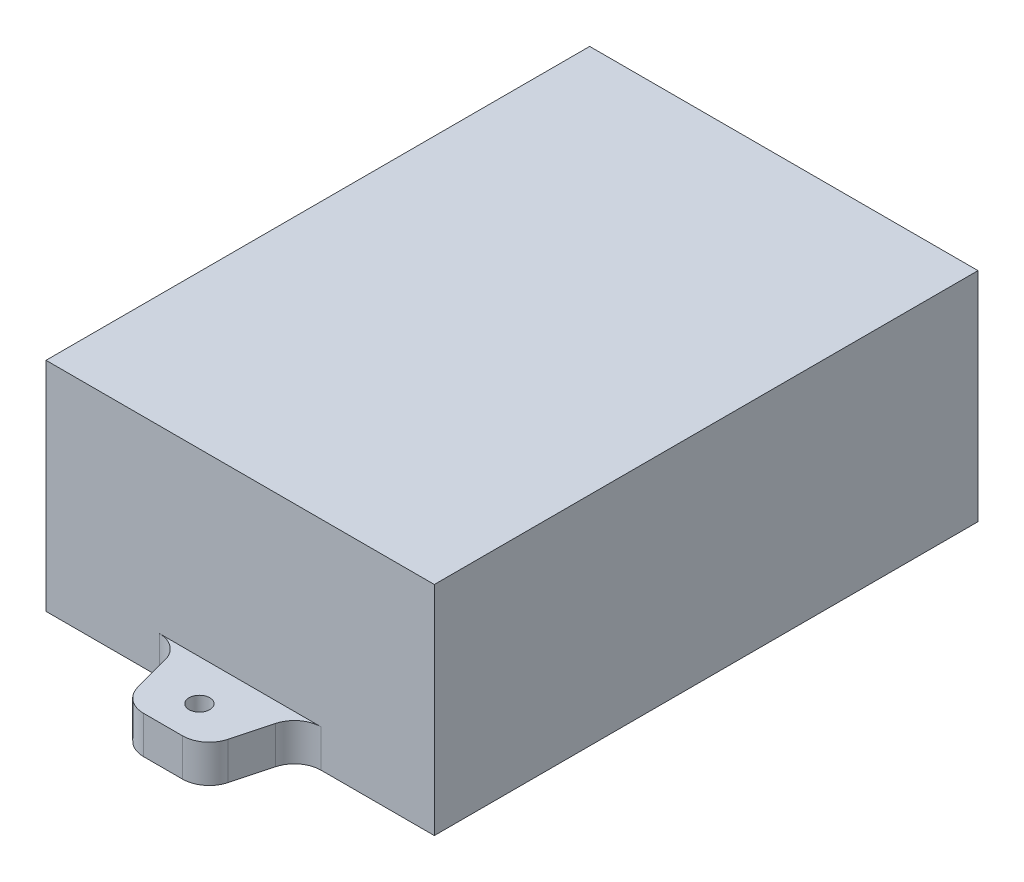
ISO-10303-21;
HEADER;
FILE_DESCRIPTION(('STEP AP214'),'2;1');
FILE_NAME('part.step','',(''),(''),'','','');
FILE_SCHEMA(('AUTOMOTIVE_DESIGN { 1 0 10303 214 1 1 1 1 }'));
ENDSEC;
DATA;
#1=APPLICATION_CONTEXT('core data for automotive mechanical design processes');
#2=APPLICATION_PROTOCOL_DEFINITION('international standard','automotive_design',2000,#1);
#3=PRODUCT_CONTEXT('',#1,'mechanical');
#4=PRODUCT('Part','Part','',(#3));
#5=PRODUCT_RELATED_PRODUCT_CATEGORY('part','',(#4));
#6=PRODUCT_DEFINITION_FORMATION('','',#4);
#7=PRODUCT_DEFINITION_CONTEXT('part definition',#1,'design');
#8=PRODUCT_DEFINITION('design','',#6,#7);
#9=PRODUCT_DEFINITION_SHAPE('','',#8);
#10=(LENGTH_UNIT() NAMED_UNIT(*) SI_UNIT(.MILLI.,.METRE.));
#11=(NAMED_UNIT(*) PLANE_ANGLE_UNIT() SI_UNIT($,.RADIAN.));
#12=(NAMED_UNIT(*) SI_UNIT($,.STERADIAN.) SOLID_ANGLE_UNIT());
#13=UNCERTAINTY_MEASURE_WITH_UNIT(LENGTH_MEASURE(1.E-05),#10,'distance_accuracy_value','');
#14=(GEOMETRIC_REPRESENTATION_CONTEXT(3) GLOBAL_UNCERTAINTY_ASSIGNED_CONTEXT((#13)) GLOBAL_UNIT_ASSIGNED_CONTEXT((#10,
#11,#12)) REPRESENTATION_CONTEXT('',''));
#15=CARTESIAN_POINT('',(0.,0.,0.));
#16=DIRECTION('',(0.,0.,1.));
#17=DIRECTION('',(1.,0.,0.));
#18=AXIS2_PLACEMENT_3D('',#15,#16,#17);
#19=CARTESIAN_POINT('',(30.,33.6,42.));
#20=DIRECTION('',(-1.,0.,0.));
#21=DIRECTION('',(0.,0.,1.));
#22=AXIS2_PLACEMENT_3D('',#19,#20,#21);
#23=PLANE('',#22);
#24=DIRECTION('',(0.,0.,-1.));
#25=VECTOR('',#24,1.);
#26=CARTESIAN_POINT('',(30.,0.,42.));
#27=LINE('',#26,#25);
#28=CARTESIAN_POINT('',(30.,0.,42.));
#29=VERTEX_POINT('',#28);
#30=CARTESIAN_POINT('',(30.,0.,-42.));
#31=VERTEX_POINT('',#30);
#32=EDGE_CURVE('E297',#29,#31,#27,.T.);
#33=ORIENTED_EDGE('',*,*,#32,.T.);
#34=DIRECTION('',(0.,-1.,0.));
#35=VECTOR('',#34,1.);
#36=CARTESIAN_POINT('',(30.,33.6,-42.));
#37=LINE('',#36,#35);
#38=CARTESIAN_POINT('',(30.,33.6,-42.));
#39=VERTEX_POINT('',#38);
#40=EDGE_CURVE('E11',#39,#31,#37,.T.);
#41=ORIENTED_EDGE('',*,*,#40,.F.);
#42=DIRECTION('',(0.,0.,-1.));
#43=VECTOR('',#42,1.);
#44=CARTESIAN_POINT('',(30.,33.6,42.));
#45=LINE('',#44,#43);
#46=CARTESIAN_POINT('',(30.,33.6,42.));
#47=VERTEX_POINT('',#46);
#48=EDGE_CURVE('E298',#47,#39,#45,.T.);
#49=ORIENTED_EDGE('',*,*,#48,.F.);
#50=DIRECTION('',(0.,-1.,0.));
#51=VECTOR('',#50,1.);
#52=CARTESIAN_POINT('',(30.,33.6,42.));
#53=LINE('',#52,#51);
#54=EDGE_CURVE('E308',#47,#29,#53,.T.);
#55=ORIENTED_EDGE('',*,*,#54,.T.);
#56=EDGE_LOOP('',(#33,#41,#49,#55));
#57=FACE_BOUND('',#56,.T.);
#58=ADVANCED_FACE('F36',(#57),#23,.F.);
#59=CARTESIAN_POINT('',(-30.,33.6,-42.));
#60=DIRECTION('',(0.,0.,1.));
#61=DIRECTION('',(1.,0.,0.));
#62=AXIS2_PLACEMENT_3D('',#59,#60,#61);
#63=PLANE('',#62);
#64=DIRECTION('',(1.,0.,0.));
#65=VECTOR('',#64,1.);
#66=CARTESIAN_POINT('',(-12.5,5.8,-42.));
#67=LINE('',#66,#65);
#68=CARTESIAN_POINT('',(-12.5,5.8,-42.));
#69=VERTEX_POINT('',#68);
#70=CARTESIAN_POINT('',(12.5,5.8,-42.));
#71=VERTEX_POINT('',#70);
#72=EDGE_CURVE('E244',#69,#71,#67,.T.);
#73=ORIENTED_EDGE('',*,*,#72,.F.);
#74=DIRECTION('',(0.,-1.,0.));
#75=VECTOR('',#74,1.);
#76=CARTESIAN_POINT('',(-12.5,5.8,-42.));
#77=LINE('',#76,#75);
#78=CARTESIAN_POINT('',(-12.5,0.,-42.));
#79=VERTEX_POINT('',#78);
#80=EDGE_CURVE('E294',#69,#79,#77,.T.);
#81=ORIENTED_EDGE('',*,*,#80,.T.);
#82=DIRECTION('',(-1.,0.,0.));
#83=VECTOR('',#82,1.);
#84=CARTESIAN_POINT('',(-30.,0.,-42.));
#85=LINE('',#84,#83);
#86=CARTESIAN_POINT('',(-30.,0.,-42.));
#87=VERTEX_POINT('',#86);
#88=EDGE_CURVE('E311',#79,#87,#85,.T.);
#89=ORIENTED_EDGE('',*,*,#88,.T.);
#90=DIRECTION('',(0.,-1.,0.));
#91=VECTOR('',#90,1.);
#92=CARTESIAN_POINT('',(-30.,33.6,-42.));
#93=LINE('',#92,#91);
#94=CARTESIAN_POINT('',(-30.,33.6,-42.));
#95=VERTEX_POINT('',#94);
#96=EDGE_CURVE('E43',#95,#87,#93,.T.);
#97=ORIENTED_EDGE('',*,*,#96,.F.);
#98=DIRECTION('',(-1.,0.,0.));
#99=VECTOR('',#98,1.);
#100=CARTESIAN_POINT('',(-30.,33.6,-42.));
#101=LINE('',#100,#99);
#102=EDGE_CURVE('E301',#39,#95,#101,.T.);
#103=ORIENTED_EDGE('',*,*,#102,.F.);
#104=ORIENTED_EDGE('',*,*,#40,.T.);
#105=CARTESIAN_POINT('',(12.5,0.,-42.));
#106=VERTEX_POINT('',#105);
#107=EDGE_CURVE('E312',#31,#106,#85,.T.);
#108=ORIENTED_EDGE('',*,*,#107,.T.);
#109=DIRECTION('',(0.,-1.,0.));
#110=VECTOR('',#109,1.);
#111=CARTESIAN_POINT('',(12.5,5.8,-42.));
#112=LINE('',#111,#110);
#113=EDGE_CURVE('E291',#71,#106,#112,.T.);
#114=ORIENTED_EDGE('',*,*,#113,.F.);
#115=EDGE_LOOP('',(#73,#81,#89,#97,#103,#104,#108,#114));
#116=FACE_BOUND('',#115,.T.);
#117=ADVANCED_FACE('F343',(#116),#63,.F.);
#118=CARTESIAN_POINT('',(-30.,33.6,42.));
#119=DIRECTION('',(1.,0.,0.));
#120=DIRECTION('',(0.,0.,-1.));
#121=AXIS2_PLACEMENT_3D('',#118,#119,#120);
#122=PLANE('',#121);
#123=DIRECTION('',(0.,0.,1.));
#124=VECTOR('',#123,1.);
#125=CARTESIAN_POINT('',(-30.,0.,42.));
#126=LINE('',#125,#124);
#127=CARTESIAN_POINT('',(-30.,0.,42.));
#128=VERTEX_POINT('',#127);
#129=EDGE_CURVE('E314',#87,#128,#126,.T.);
#130=ORIENTED_EDGE('',*,*,#129,.T.);
#131=DIRECTION('',(0.,-1.,0.));
#132=VECTOR('',#131,1.);
#133=CARTESIAN_POINT('',(-30.,33.6,42.));
#134=LINE('',#133,#132);
#135=CARTESIAN_POINT('',(-30.,33.6,42.));
#136=VERTEX_POINT('',#135);
#137=EDGE_CURVE('E320',#136,#128,#134,.T.);
#138=ORIENTED_EDGE('',*,*,#137,.F.);
#139=DIRECTION('',(0.,0.,1.));
#140=VECTOR('',#139,1.);
#141=CARTESIAN_POINT('',(-30.,33.6,42.));
#142=LINE('',#141,#140);
#143=EDGE_CURVE('E304',#95,#136,#142,.T.);
#144=ORIENTED_EDGE('',*,*,#143,.F.);
#145=ORIENTED_EDGE('',*,*,#96,.T.);
#146=EDGE_LOOP('',(#130,#138,#144,#145));
#147=FACE_BOUND('',#146,.T.);
#148=ADVANCED_FACE('F327',(#147),#122,.F.);
#149=CARTESIAN_POINT('',(-30.,33.6,42.));
#150=DIRECTION('',(0.,0.,-1.));
#151=DIRECTION('',(-1.,0.,0.));
#152=AXIS2_PLACEMENT_3D('',#149,#150,#151);
#153=PLANE('',#152);
#154=DIRECTION('',(-1.,0.,0.));
#155=VECTOR('',#154,1.);
#156=CARTESIAN_POINT('',(-12.5,5.8,42.));
#157=LINE('',#156,#155);
#158=CARTESIAN_POINT('',(12.5,5.8,42.));
#159=VERTEX_POINT('',#158);
#160=CARTESIAN_POINT('',(-12.5,5.8,42.));
#161=VERTEX_POINT('',#160);
#162=EDGE_CURVE('E50',#159,#161,#157,.T.);
#163=ORIENTED_EDGE('',*,*,#162,.F.);
#164=DIRECTION('',(0.,-1.,0.));
#165=VECTOR('',#164,1.);
#166=CARTESIAN_POINT('',(12.5,5.8,42.));
#167=LINE('',#166,#165);
#168=CARTESIAN_POINT('',(12.5,0.,42.));
#169=VERTEX_POINT('',#168);
#170=EDGE_CURVE('E232',#159,#169,#167,.T.);
#171=ORIENTED_EDGE('',*,*,#170,.T.);
#172=DIRECTION('',(1.,0.,0.));
#173=VECTOR('',#172,1.);
#174=CARTESIAN_POINT('',(-30.,0.,42.));
#175=LINE('',#174,#173);
#176=EDGE_CURVE('E316',#169,#29,#175,.T.);
#177=ORIENTED_EDGE('',*,*,#176,.T.);
#178=ORIENTED_EDGE('',*,*,#54,.F.);
#179=DIRECTION('',(1.,0.,0.));
#180=VECTOR('',#179,1.);
#181=CARTESIAN_POINT('',(-30.,33.6,42.));
#182=LINE('',#181,#180);
#183=EDGE_CURVE('E306',#136,#47,#182,.T.);
#184=ORIENTED_EDGE('',*,*,#183,.F.);
#185=ORIENTED_EDGE('',*,*,#137,.T.);
#186=CARTESIAN_POINT('',(-12.5,0.,42.));
#187=VERTEX_POINT('',#186);
#188=EDGE_CURVE('E302',#128,#187,#175,.T.);
#189=ORIENTED_EDGE('',*,*,#188,.T.);
#190=DIRECTION('',(0.,-1.,0.));
#191=VECTOR('',#190,1.);
#192=CARTESIAN_POINT('',(-12.5,5.8,42.));
#193=LINE('',#192,#191);
#194=EDGE_CURVE('E55',#161,#187,#193,.T.);
#195=ORIENTED_EDGE('',*,*,#194,.F.);
#196=EDGE_LOOP('',(#163,#171,#177,#178,#184,#185,#189,#195));
#197=FACE_BOUND('',#196,.T.);
#198=ADVANCED_FACE('F336',(#197),#153,.F.);
#199=CARTESIAN_POINT('',(0.,33.6,0.));
#200=DIRECTION('',(0.,-1.,0.));
#201=DIRECTION('',(0.,0.,-1.));
#202=AXIS2_PLACEMENT_3D('',#199,#200,#201);
#203=PLANE('',#202);
#204=ORIENTED_EDGE('',*,*,#48,.T.);
#205=ORIENTED_EDGE('',*,*,#102,.T.);
#206=ORIENTED_EDGE('',*,*,#143,.T.);
#207=ORIENTED_EDGE('',*,*,#183,.T.);
#208=EDGE_LOOP('',(#204,#205,#206,#207));
#209=FACE_BOUND('',#208,.T.);
#210=ADVANCED_FACE('F341',(#209),#203,.F.);
#211=CARTESIAN_POINT('',(0.,0.,0.));
#212=DIRECTION('',(0.,-1.,0.));
#213=DIRECTION('',(0.,0.,-1.));
#214=AXIS2_PLACEMENT_3D('',#211,#212,#213);
#215=PLANE('',#214);
#216=ORIENTED_EDGE('',*,*,#32,.F.);
#217=ORIENTED_EDGE('',*,*,#176,.F.);
#218=CARTESIAN_POINT('',(12.5,0.,46.1125913130549));
#219=DIRECTION('',(0.,-1.,0.));
#220=DIRECTION('',(0.,0.,-1.));
#221=AXIS2_PLACEMENT_3D('',#218,#219,#220);
#222=CIRCLE('',#221,4.11259131305487);
#223=CARTESIAN_POINT('',(8.52754183774822,0.,45.0481743565131));
#224=VERTEX_POINT('',#223);
#225=EDGE_CURVE('E203',#224,#169,#222,.T.);
#226=ORIENTED_EDGE('',*,*,#225,.F.);
#227=DIRECTION('',(0.258819045102518,0.,-0.965925826289069));
#228=VECTOR('',#227,1.);
#229=CARTESIAN_POINT('',(6.97245816225176,0.,50.8518256434869));
#230=LINE('',#229,#228);
#231=CARTESIAN_POINT('',(6.97245816225176,0.,50.8518256434869));
#232=VERTEX_POINT('',#231);
#233=EDGE_CURVE('E216',#232,#224,#230,.T.);
#234=ORIENTED_EDGE('',*,*,#233,.F.);
#235=CARTESIAN_POINT('',(2.99999999999999,0.,49.7874086869451));
#236=DIRECTION('',(0.,1.,0.));
#237=DIRECTION('',(0.,0.,1.));
#238=AXIS2_PLACEMENT_3D('',#235,#236,#237);
#239=CIRCLE('',#238,4.11259131305487);
#240=CARTESIAN_POINT('',(2.99999999999999,0.,53.9));
#241=VERTEX_POINT('',#240);
#242=EDGE_CURVE('E214',#241,#232,#239,.T.);
#243=ORIENTED_EDGE('',*,*,#242,.F.);
#244=DIRECTION('',(1.,0.,0.));
#245=VECTOR('',#244,1.);
#246=CARTESIAN_POINT('',(-3.00000000000001,0.,53.9));
#247=LINE('',#246,#245);
#248=CARTESIAN_POINT('',(-3.00000000000001,0.,53.9));
#249=VERTEX_POINT('',#248);
#250=EDGE_CURVE('E212',#249,#241,#247,.T.);
#251=ORIENTED_EDGE('',*,*,#250,.F.);
#252=CARTESIAN_POINT('',(-3.00000000000001,0.,49.7874086869451));
#253=DIRECTION('',(0.,1.,0.));
#254=DIRECTION('',(0.,0.,-1.));
#255=AXIS2_PLACEMENT_3D('',#252,#253,#254);
#256=CIRCLE('',#255,4.11259131305487);
#257=CARTESIAN_POINT('',(-6.97245816225178,0.,50.8518256434869));
#258=VERTEX_POINT('',#257);
#259=EDGE_CURVE('E210',#258,#249,#256,.T.);
#260=ORIENTED_EDGE('',*,*,#259,.F.);
#261=DIRECTION('',(0.258819045102518,0.,0.965925826289069));
#262=VECTOR('',#261,1.);
#263=CARTESIAN_POINT('',(-8.52754183774825,0.,45.0481743565131));
#264=LINE('',#263,#262);
#265=CARTESIAN_POINT('',(-8.52754183774825,0.,45.0481743565131));
#266=VERTEX_POINT('',#265);
#267=EDGE_CURVE('E208',#266,#258,#264,.T.);
#268=ORIENTED_EDGE('',*,*,#267,.F.);
#269=CARTESIAN_POINT('',(-12.5,0.,46.1125913130549));
#270=DIRECTION('',(0.,-1.,0.));
#271=DIRECTION('',(0.,0.,-1.));
#272=AXIS2_PLACEMENT_3D('',#269,#270,#271);
#273=CIRCLE('',#272,4.11259131305487);
#274=EDGE_CURVE('E183',#187,#266,#273,.T.);
#275=ORIENTED_EDGE('',*,*,#274,.F.);
#276=ORIENTED_EDGE('',*,*,#188,.F.);
#277=ORIENTED_EDGE('',*,*,#129,.F.);
#278=ORIENTED_EDGE('',*,*,#88,.F.);
#279=CARTESIAN_POINT('',(-12.5,0.,-46.1125913130549));
#280=DIRECTION('',(0.,-1.,0.));
#281=DIRECTION('',(0.,0.,1.));
#282=AXIS2_PLACEMENT_3D('',#279,#280,#281);
#283=CIRCLE('',#282,4.11259131305487);
#284=CARTESIAN_POINT('',(-8.52754183774823,0.,-45.0481743565131));
#285=VERTEX_POINT('',#284);
#286=EDGE_CURVE('E238',#285,#79,#283,.T.);
#287=ORIENTED_EDGE('',*,*,#286,.F.);
#288=DIRECTION('',(-0.258819045102518,0.,0.965925826289069));
#289=VECTOR('',#288,1.);
#290=CARTESIAN_POINT('',(-8.52754183774823,0.,-45.0481743565131));
#291=LINE('',#290,#289);
#292=CARTESIAN_POINT('',(-6.97245816225177,0.,-50.8518256434869));
#293=VERTEX_POINT('',#292);
#294=EDGE_CURVE('E245',#293,#285,#291,.T.);
#295=ORIENTED_EDGE('',*,*,#294,.F.);
#296=CARTESIAN_POINT('',(-3.,0.,-49.7874086869451));
#297=DIRECTION('',(0.,1.,0.));
#298=DIRECTION('',(0.,0.,1.));
#299=AXIS2_PLACEMENT_3D('',#296,#297,#298);
#300=CIRCLE('',#299,4.11259131305487);
#301=CARTESIAN_POINT('',(-3.,0.,-53.9));
#302=VERTEX_POINT('',#301);
#303=EDGE_CURVE('E271',#302,#293,#300,.T.);
#304=ORIENTED_EDGE('',*,*,#303,.F.);
#305=DIRECTION('',(-1.,0.,0.));
#306=VECTOR('',#305,1.);
#307=CARTESIAN_POINT('',(-3.,0.,-53.9));
#308=LINE('',#307,#306);
#309=CARTESIAN_POINT('',(3.,0.,-53.9));
#310=VERTEX_POINT('',#309);
#311=EDGE_CURVE('E269',#310,#302,#308,.T.);
#312=ORIENTED_EDGE('',*,*,#311,.F.);
#313=CARTESIAN_POINT('',(3.,0.,-49.7874086869451));
#314=DIRECTION('',(0.,1.,0.));
#315=DIRECTION('',(0.,0.,-1.));
#316=AXIS2_PLACEMENT_3D('',#313,#314,#315);
#317=CIRCLE('',#316,4.11259131305487);
#318=CARTESIAN_POINT('',(6.97245816225177,0.,-50.8518256434869));
#319=VERTEX_POINT('',#318);
#320=EDGE_CURVE('E267',#319,#310,#317,.T.);
#321=ORIENTED_EDGE('',*,*,#320,.F.);
#322=DIRECTION('',(-0.258819045102518,0.,-0.965925826289069));
#323=VECTOR('',#322,1.);
#324=CARTESIAN_POINT('',(6.97245816225177,0.,-50.8518256434869));
#325=LINE('',#324,#323);
#326=CARTESIAN_POINT('',(8.52754183774822,0.,-45.0481743565131));
#327=VERTEX_POINT('',#326);
#328=EDGE_CURVE('E265',#327,#319,#325,.T.);
#329=ORIENTED_EDGE('',*,*,#328,.F.);
#330=CARTESIAN_POINT('',(12.5,0.,-46.1125913130549));
#331=DIRECTION('',(0.,-1.,0.));
#332=DIRECTION('',(0.,0.,1.));
#333=AXIS2_PLACEMENT_3D('',#330,#331,#332);
#334=CIRCLE('',#333,4.11259131305487);
#335=EDGE_CURVE('E263',#106,#327,#334,.T.);
#336=ORIENTED_EDGE('',*,*,#335,.F.);
#337=ORIENTED_EDGE('',*,*,#107,.F.);
#338=EDGE_LOOP('',(#216,#217,#226,#234,#243,#251,#260,#268,#275,#276,#277,#278,#287,#295,#304,
#312,#321,#329,#336,#337));
#339=FACE_BOUND('',#338,.T.);
#340=CARTESIAN_POINT('',(0.,0.,-48.3));
#341=DIRECTION('',(0.,1.,0.));
#342=DIRECTION('',(0.,0.,1.));
#343=AXIS2_PLACEMENT_3D('',#340,#341,#342);
#344=CIRCLE('',#343,1.6);
#345=CARTESIAN_POINT('',(0.,0.,-46.7));
#346=VERTEX_POINT('',#345);
#347=EDGE_CURVE('E234',#346,#346,#344,.T.);
#348=ORIENTED_EDGE('',*,*,#347,.T.);
#349=EDGE_LOOP('',(#348));
#350=FACE_BOUND('',#349,.T.);
#351=CARTESIAN_POINT('',(0.,0.,48.3));
#352=DIRECTION('',(0.,1.,0.));
#353=DIRECTION('',(0.,0.,-1.));
#354=AXIS2_PLACEMENT_3D('',#351,#352,#353);
#355=CIRCLE('',#354,1.6);
#356=CARTESIAN_POINT('',(0.,0.,46.7));
#357=VERTEX_POINT('',#356);
#358=EDGE_CURVE('E598',#357,#357,#355,.T.);
#359=ORIENTED_EDGE('',*,*,#358,.T.);
#360=EDGE_LOOP('',(#359));
#361=FACE_BOUND('',#360,.T.);
#362=ADVANCED_FACE('F333',(#339,#350,#361),#215,.T.);
#363=CARTESIAN_POINT('',(-12.5,5.8,-46.1125913130549));
#364=DIRECTION('',(0.,1.,0.));
#365=DIRECTION('',(0.,0.,1.));
#366=AXIS2_PLACEMENT_3D('',#363,#364,#365);
#367=PLANE('',#366);
#368=CARTESIAN_POINT('',(-12.5,5.8,-46.1125913130549));
#369=DIRECTION('',(0.,-1.,0.));
#370=DIRECTION('',(0.,0.,1.));
#371=AXIS2_PLACEMENT_3D('',#368,#369,#370);
#372=CIRCLE('',#371,4.11259131305487);
#373=CARTESIAN_POINT('',(-8.52754183774823,5.8,-45.0481743565131));
#374=VERTEX_POINT('',#373);
#375=EDGE_CURVE('E241',#374,#69,#372,.T.);
#376=ORIENTED_EDGE('',*,*,#375,.T.);
#377=ORIENTED_EDGE('',*,*,#72,.T.);
#378=CARTESIAN_POINT('',(12.5,5.8,-46.1125913130549));
#379=DIRECTION('',(0.,-1.,0.));
#380=DIRECTION('',(0.,0.,1.));
#381=AXIS2_PLACEMENT_3D('',#378,#379,#380);
#382=CIRCLE('',#381,4.11259131305487);
#383=CARTESIAN_POINT('',(8.52754183774822,5.8,-45.0481743565131));
#384=VERTEX_POINT('',#383);
#385=EDGE_CURVE('E248',#71,#384,#382,.T.);
#386=ORIENTED_EDGE('',*,*,#385,.T.);
#387=DIRECTION('',(-0.258819045102518,0.,-0.965925826289069));
#388=VECTOR('',#387,1.);
#389=CARTESIAN_POINT('',(6.97245816225177,5.8,-50.8518256434869));
#390=LINE('',#389,#388);
#391=CARTESIAN_POINT('',(6.97245816225177,5.8,-50.8518256434869));
#392=VERTEX_POINT('',#391);
#393=EDGE_CURVE('E250',#384,#392,#390,.T.);
#394=ORIENTED_EDGE('',*,*,#393,.T.);
#395=CARTESIAN_POINT('',(3.,5.8,-49.7874086869451));
#396=DIRECTION('',(0.,1.,0.));
#397=DIRECTION('',(0.,0.,-1.));
#398=AXIS2_PLACEMENT_3D('',#395,#396,#397);
#399=CIRCLE('',#398,4.11259131305487);
#400=CARTESIAN_POINT('',(3.,5.8,-53.9));
#401=VERTEX_POINT('',#400);
#402=EDGE_CURVE('E252',#392,#401,#399,.T.);
#403=ORIENTED_EDGE('',*,*,#402,.T.);
#404=DIRECTION('',(-1.,0.,0.));
#405=VECTOR('',#404,1.);
#406=CARTESIAN_POINT('',(-3.,5.8,-53.9));
#407=LINE('',#406,#405);
#408=CARTESIAN_POINT('',(-3.,5.8,-53.9));
#409=VERTEX_POINT('',#408);
#410=EDGE_CURVE('E254',#401,#409,#407,.T.);
#411=ORIENTED_EDGE('',*,*,#410,.T.);
#412=CARTESIAN_POINT('',(-3.,5.8,-49.7874086869451));
#413=DIRECTION('',(0.,1.,0.));
#414=DIRECTION('',(0.,0.,1.));
#415=AXIS2_PLACEMENT_3D('',#412,#413,#414);
#416=CIRCLE('',#415,4.11259131305487);
#417=CARTESIAN_POINT('',(-6.97245816225177,5.8,-50.8518256434869));
#418=VERTEX_POINT('',#417);
#419=EDGE_CURVE('E256',#409,#418,#416,.T.);
#420=ORIENTED_EDGE('',*,*,#419,.T.);
#421=DIRECTION('',(-0.258819045102518,0.,0.965925826289069));
#422=VECTOR('',#421,1.);
#423=CARTESIAN_POINT('',(-8.52754183774823,5.8,-45.0481743565131));
#424=LINE('',#423,#422);
#425=EDGE_CURVE('E258',#418,#374,#424,.T.);
#426=ORIENTED_EDGE('',*,*,#425,.T.);
#427=EDGE_LOOP('',(#376,#377,#386,#394,#403,#411,#420,#426));
#428=FACE_BOUND('',#427,.T.);
#429=CARTESIAN_POINT('',(0.,5.8,-48.3));
#430=DIRECTION('',(0.,1.,0.));
#431=DIRECTION('',(0.,0.,1.));
#432=AXIS2_PLACEMENT_3D('',#429,#430,#431);
#433=CIRCLE('',#432,1.6);
#434=CARTESIAN_POINT('',(0.,5.8,-46.7));
#435=VERTEX_POINT('',#434);
#436=EDGE_CURVE('E235',#435,#435,#433,.T.);
#437=ORIENTED_EDGE('',*,*,#436,.F.);
#438=EDGE_LOOP('',(#437));
#439=FACE_BOUND('',#438,.T.);
#440=ADVANCED_FACE('F359',(#428,#439),#367,.T.);
#441=CARTESIAN_POINT('',(-12.5,5.8,-46.1125913130549));
#442=DIRECTION('',(0.,-1.,0.));
#443=DIRECTION('',(0.,0.,-1.));
#444=AXIS2_PLACEMENT_3D('',#441,#442,#443);
#445=CYLINDRICAL_SURFACE('',#444,4.11259131305487);
#446=ORIENTED_EDGE('',*,*,#286,.T.);
#447=ORIENTED_EDGE('',*,*,#80,.F.);
#448=ORIENTED_EDGE('',*,*,#375,.F.);
#449=DIRECTION('',(0.,-1.,0.));
#450=VECTOR('',#449,1.);
#451=CARTESIAN_POINT('',(-8.52754183774823,5.8,-45.0481743565131));
#452=LINE('',#451,#450);
#453=EDGE_CURVE('E260',#374,#285,#452,.T.);
#454=ORIENTED_EDGE('',*,*,#453,.T.);
#455=EDGE_LOOP('',(#446,#447,#448,#454));
#456=FACE_BOUND('',#455,.T.);
#457=ADVANCED_FACE('F365',(#456),#445,.F.);
#458=CARTESIAN_POINT('',(12.5,5.8,-46.1125913130549));
#459=DIRECTION('',(0.,-1.,0.));
#460=DIRECTION('',(0.,0.,-1.));
#461=AXIS2_PLACEMENT_3D('',#458,#459,#460);
#462=CYLINDRICAL_SURFACE('',#461,4.11259131305487);
#463=ORIENTED_EDGE('',*,*,#335,.T.);
#464=DIRECTION('',(0.,-1.,0.));
#465=VECTOR('',#464,1.);
#466=CARTESIAN_POINT('',(8.52754183774822,5.8,-45.0481743565131));
#467=LINE('',#466,#465);
#468=EDGE_CURVE('E288',#384,#327,#467,.T.);
#469=ORIENTED_EDGE('',*,*,#468,.F.);
#470=ORIENTED_EDGE('',*,*,#385,.F.);
#471=ORIENTED_EDGE('',*,*,#113,.T.);
#472=EDGE_LOOP('',(#463,#469,#470,#471));
#473=FACE_BOUND('',#472,.T.);
#474=ADVANCED_FACE('F351',(#473),#462,.F.);
#475=CARTESIAN_POINT('',(6.97245816225177,5.8,-50.8518256434869));
#476=DIRECTION('',(-0.965925826289069,0.,0.258819045102518));
#477=DIRECTION('',(0.258819045102518,0.,0.965925826289069));
#478=AXIS2_PLACEMENT_3D('',#475,#476,#477);
#479=PLANE('',#478);
#480=ORIENTED_EDGE('',*,*,#328,.T.);
#481=DIRECTION('',(0.,-1.,0.));
#482=VECTOR('',#481,1.);
#483=CARTESIAN_POINT('',(6.97245816225177,5.8,-50.8518256434869));
#484=LINE('',#483,#482);
#485=EDGE_CURVE('E285',#392,#319,#484,.T.);
#486=ORIENTED_EDGE('',*,*,#485,.F.);
#487=ORIENTED_EDGE('',*,*,#393,.F.);
#488=ORIENTED_EDGE('',*,*,#468,.T.);
#489=EDGE_LOOP('',(#480,#486,#487,#488));
#490=FACE_BOUND('',#489,.T.);
#491=ADVANCED_FACE('F355',(#490),#479,.F.);
#492=CARTESIAN_POINT('',(3.,5.8,-49.7874086869451));
#493=DIRECTION('',(0.,-1.,0.));
#494=DIRECTION('',(0.,0.,-1.));
#495=AXIS2_PLACEMENT_3D('',#492,#493,#494);
#496=CYLINDRICAL_SURFACE('',#495,4.11259131305487);
#497=ORIENTED_EDGE('',*,*,#320,.T.);
#498=DIRECTION('',(0.,-1.,0.));
#499=VECTOR('',#498,1.);
#500=CARTESIAN_POINT('',(3.,5.8,-53.9));
#501=LINE('',#500,#499);
#502=EDGE_CURVE('E282',#401,#310,#501,.T.);
#503=ORIENTED_EDGE('',*,*,#502,.F.);
#504=ORIENTED_EDGE('',*,*,#402,.F.);
#505=ORIENTED_EDGE('',*,*,#485,.T.);
#506=EDGE_LOOP('',(#497,#503,#504,#505));
#507=FACE_BOUND('',#506,.T.);
#508=ADVANCED_FACE('F382',(#507),#496,.T.);
#509=CARTESIAN_POINT('',(-3.,5.8,-53.9));
#510=DIRECTION('',(0.,0.,1.));
#511=DIRECTION('',(1.,0.,0.));
#512=AXIS2_PLACEMENT_3D('',#509,#510,#511);
#513=PLANE('',#512);
#514=ORIENTED_EDGE('',*,*,#311,.T.);
#515=DIRECTION('',(0.,-1.,0.));
#516=VECTOR('',#515,1.);
#517=CARTESIAN_POINT('',(-3.,5.8,-53.9));
#518=LINE('',#517,#516);
#519=EDGE_CURVE('E279',#409,#302,#518,.T.);
#520=ORIENTED_EDGE('',*,*,#519,.F.);
#521=ORIENTED_EDGE('',*,*,#410,.F.);
#522=ORIENTED_EDGE('',*,*,#502,.T.);
#523=EDGE_LOOP('',(#514,#520,#521,#522));
#524=FACE_BOUND('',#523,.T.);
#525=ADVANCED_FACE('F380',(#524),#513,.F.);
#526=CARTESIAN_POINT('',(-3.,5.8,-49.7874086869451));
#527=DIRECTION('',(0.,-1.,0.));
#528=DIRECTION('',(0.,0.,-1.));
#529=AXIS2_PLACEMENT_3D('',#526,#527,#528);
#530=CYLINDRICAL_SURFACE('',#529,4.11259131305487);
#531=ORIENTED_EDGE('',*,*,#303,.T.);
#532=DIRECTION('',(0.,-1.,0.));
#533=VECTOR('',#532,1.);
#534=CARTESIAN_POINT('',(-6.97245816225177,5.8,-50.8518256434869));
#535=LINE('',#534,#533);
#536=EDGE_CURVE('E276',#418,#293,#535,.T.);
#537=ORIENTED_EDGE('',*,*,#536,.F.);
#538=ORIENTED_EDGE('',*,*,#419,.F.);
#539=ORIENTED_EDGE('',*,*,#519,.T.);
#540=EDGE_LOOP('',(#531,#537,#538,#539));
#541=FACE_BOUND('',#540,.T.);
#542=ADVANCED_FACE('F376',(#541),#530,.T.);
#543=CARTESIAN_POINT('',(-8.52754183774823,5.8,-45.0481743565131));
#544=DIRECTION('',(0.965925826289069,0.,0.258819045102518));
#545=DIRECTION('',(0.258819045102518,0.,-0.965925826289069));
#546=AXIS2_PLACEMENT_3D('',#543,#544,#545);
#547=PLANE('',#546);
#548=ORIENTED_EDGE('',*,*,#294,.T.);
#549=ORIENTED_EDGE('',*,*,#453,.F.);
#550=ORIENTED_EDGE('',*,*,#425,.F.);
#551=ORIENTED_EDGE('',*,*,#536,.T.);
#552=EDGE_LOOP('',(#548,#549,#550,#551));
#553=FACE_BOUND('',#552,.T.);
#554=ADVANCED_FACE('F371',(#553),#547,.F.);
#555=CARTESIAN_POINT('',(0.,5.8,-48.3));
#556=DIRECTION('',(0.,-1.,0.));
#557=DIRECTION('',(0.,0.,-1.));
#558=AXIS2_PLACEMENT_3D('',#555,#556,#557);
#559=CYLINDRICAL_SURFACE('',#558,1.6);
#560=ORIENTED_EDGE('',*,*,#436,.T.);
#561=EDGE_LOOP('',(#560));
#562=FACE_BOUND('',#561,.T.);
#563=ORIENTED_EDGE('',*,*,#347,.F.);
#564=EDGE_LOOP('',(#563));
#565=FACE_BOUND('',#564,.T.);
#566=ADVANCED_FACE('F445',(#562,#565),#559,.F.);
#567=CARTESIAN_POINT('',(12.5,5.8,46.1125913130549));
#568=DIRECTION('',(0.,-1.,0.));
#569=DIRECTION('',(0.,0.,-1.));
#570=AXIS2_PLACEMENT_3D('',#567,#568,#569);
#571=PLANE('',#570);
#572=CARTESIAN_POINT('',(12.5,5.8,46.1125913130549));
#573=DIRECTION('',(0.,-1.,0.));
#574=DIRECTION('',(0.,0.,-1.));
#575=AXIS2_PLACEMENT_3D('',#572,#573,#574);
#576=CIRCLE('',#575,4.11259131305487);
#577=CARTESIAN_POINT('',(8.52754183774822,5.8,45.0481743565131));
#578=VERTEX_POINT('',#577);
#579=EDGE_CURVE('E218',#578,#159,#576,.T.);
#580=ORIENTED_EDGE('',*,*,#579,.T.);
#581=ORIENTED_EDGE('',*,*,#162,.T.);
#582=CARTESIAN_POINT('',(-12.5,5.8,46.1125913130549));
#583=DIRECTION('',(0.,-1.,0.));
#584=DIRECTION('',(0.,0.,-1.));
#585=AXIS2_PLACEMENT_3D('',#582,#583,#584);
#586=CIRCLE('',#585,4.11259131305487);
#587=CARTESIAN_POINT('',(-8.52754183774825,5.8,45.0481743565131));
#588=VERTEX_POINT('',#587);
#589=EDGE_CURVE('E170',#161,#588,#586,.T.);
#590=ORIENTED_EDGE('',*,*,#589,.T.);
#591=DIRECTION('',(0.258819045102518,0.,0.965925826289069));
#592=VECTOR('',#591,1.);
#593=CARTESIAN_POINT('',(-8.52754183774825,5.8,45.0481743565131));
#594=LINE('',#593,#592);
#595=CARTESIAN_POINT('',(-6.97245816225178,5.8,50.8518256434869));
#596=VERTEX_POINT('',#595);
#597=EDGE_CURVE('E175',#588,#596,#594,.T.);
#598=ORIENTED_EDGE('',*,*,#597,.T.);
#599=CARTESIAN_POINT('',(-3.00000000000001,5.8,49.7874086869451));
#600=DIRECTION('',(0.,1.,0.));
#601=DIRECTION('',(0.,0.,-1.));
#602=AXIS2_PLACEMENT_3D('',#599,#600,#601);
#603=CIRCLE('',#602,4.11259131305487);
#604=CARTESIAN_POINT('',(-3.00000000000001,5.8,53.9));
#605=VERTEX_POINT('',#604);
#606=EDGE_CURVE('E191',#596,#605,#603,.T.);
#607=ORIENTED_EDGE('',*,*,#606,.T.);
#608=DIRECTION('',(1.,0.,0.));
#609=VECTOR('',#608,1.);
#610=CARTESIAN_POINT('',(-3.00000000000001,5.8,53.9));
#611=LINE('',#610,#609);
#612=CARTESIAN_POINT('',(2.99999999999999,5.8,53.9));
#613=VERTEX_POINT('',#612);
#614=EDGE_CURVE('E193',#605,#613,#611,.T.);
#615=ORIENTED_EDGE('',*,*,#614,.T.);
#616=CARTESIAN_POINT('',(2.99999999999999,5.8,49.7874086869451));
#617=DIRECTION('',(0.,1.,0.));
#618=DIRECTION('',(0.,0.,1.));
#619=AXIS2_PLACEMENT_3D('',#616,#617,#618);
#620=CIRCLE('',#619,4.11259131305487);
#621=CARTESIAN_POINT('',(6.97245816225176,5.8,50.8518256434869));
#622=VERTEX_POINT('',#621);
#623=EDGE_CURVE('E198',#613,#622,#620,.T.);
#624=ORIENTED_EDGE('',*,*,#623,.T.);
#625=DIRECTION('',(0.258819045102518,0.,-0.965925826289069));
#626=VECTOR('',#625,1.);
#627=CARTESIAN_POINT('',(6.97245816225176,5.8,50.8518256434869));
#628=LINE('',#627,#626);
#629=EDGE_CURVE('E200',#622,#578,#628,.T.);
#630=ORIENTED_EDGE('',*,*,#629,.T.);
#631=EDGE_LOOP('',(#580,#581,#590,#598,#607,#615,#624,#630));
#632=FACE_BOUND('',#631,.T.);
#633=CARTESIAN_POINT('',(0.,5.8,48.3));
#634=DIRECTION('',(0.,1.,0.));
#635=DIRECTION('',(0.,0.,-1.));
#636=AXIS2_PLACEMENT_3D('',#633,#634,#635);
#637=CIRCLE('',#636,1.6);
#638=CARTESIAN_POINT('',(0.,5.8,46.7));
#639=VERTEX_POINT('',#638);
#640=EDGE_CURVE('E206',#639,#639,#637,.T.);
#641=ORIENTED_EDGE('',*,*,#640,.F.);
#642=EDGE_LOOP('',(#641));
#643=FACE_BOUND('',#642,.T.);
#644=ADVANCED_FACE('F172',(#632,#643),#571,.F.);
#645=CARTESIAN_POINT('',(12.5,5.8,46.1125913130549));
#646=DIRECTION('',(0.,-1.,0.));
#647=DIRECTION('',(0.,0.,-1.));
#648=AXIS2_PLACEMENT_3D('',#645,#646,#647);
#649=CYLINDRICAL_SURFACE('',#648,4.11259131305487);
#650=ORIENTED_EDGE('',*,*,#225,.T.);
#651=ORIENTED_EDGE('',*,*,#170,.F.);
#652=ORIENTED_EDGE('',*,*,#579,.F.);
#653=DIRECTION('',(0.,-1.,0.));
#654=VECTOR('',#653,1.);
#655=CARTESIAN_POINT('',(8.52754183774822,5.8,45.0481743565131));
#656=LINE('',#655,#654);
#657=EDGE_CURVE('E202',#578,#224,#656,.T.);
#658=ORIENTED_EDGE('',*,*,#657,.T.);
#659=EDGE_LOOP('',(#650,#651,#652,#658));
#660=FACE_BOUND('',#659,.T.);
#661=ADVANCED_FACE('F463',(#660),#649,.F.);
#662=CARTESIAN_POINT('',(-12.5,5.8,46.1125913130549));
#663=DIRECTION('',(0.,-1.,0.));
#664=DIRECTION('',(0.,0.,-1.));
#665=AXIS2_PLACEMENT_3D('',#662,#663,#664);
#666=CYLINDRICAL_SURFACE('',#665,4.11259131305487);
#667=ORIENTED_EDGE('',*,*,#274,.T.);
#668=DIRECTION('',(0.,-1.,0.));
#669=VECTOR('',#668,1.);
#670=CARTESIAN_POINT('',(-8.52754183774825,5.8,45.0481743565131));
#671=LINE('',#670,#669);
#672=EDGE_CURVE('E180',#588,#266,#671,.T.);
#673=ORIENTED_EDGE('',*,*,#672,.F.);
#674=ORIENTED_EDGE('',*,*,#589,.F.);
#675=ORIENTED_EDGE('',*,*,#194,.T.);
#676=EDGE_LOOP('',(#667,#673,#674,#675));
#677=FACE_BOUND('',#676,.T.);
#678=ADVANCED_FACE('F181',(#677),#666,.F.);
#679=CARTESIAN_POINT('',(-8.52754183774825,5.8,45.0481743565131));
#680=DIRECTION('',(0.965925826289069,0.,-0.258819045102518));
#681=DIRECTION('',(-0.258819045102518,0.,-0.965925826289069));
#682=AXIS2_PLACEMENT_3D('',#679,#680,#681);
#683=PLANE('',#682);
#684=ORIENTED_EDGE('',*,*,#267,.T.);
#685=DIRECTION('',(0.,-1.,0.));
#686=VECTOR('',#685,1.);
#687=CARTESIAN_POINT('',(-6.97245816225178,5.8,50.8518256434869));
#688=LINE('',#687,#686);
#689=EDGE_CURVE('E186',#596,#258,#688,.T.);
#690=ORIENTED_EDGE('',*,*,#689,.F.);
#691=ORIENTED_EDGE('',*,*,#597,.F.);
#692=ORIENTED_EDGE('',*,*,#672,.T.);
#693=EDGE_LOOP('',(#684,#690,#691,#692));
#694=FACE_BOUND('',#693,.T.);
#695=ADVANCED_FACE('F188',(#694),#683,.F.);
#696=CARTESIAN_POINT('',(-3.00000000000001,5.8,49.7874086869451));
#697=DIRECTION('',(0.,-1.,0.));
#698=DIRECTION('',(0.,0.,-1.));
#699=AXIS2_PLACEMENT_3D('',#696,#697,#698);
#700=CYLINDRICAL_SURFACE('',#699,4.11259131305487);
#701=ORIENTED_EDGE('',*,*,#259,.T.);
#702=DIRECTION('',(0.,-1.,0.));
#703=VECTOR('',#702,1.);
#704=CARTESIAN_POINT('',(-3.00000000000001,5.8,53.9));
#705=LINE('',#704,#703);
#706=EDGE_CURVE('E227',#605,#249,#705,.T.);
#707=ORIENTED_EDGE('',*,*,#706,.F.);
#708=ORIENTED_EDGE('',*,*,#606,.F.);
#709=ORIENTED_EDGE('',*,*,#689,.T.);
#710=EDGE_LOOP('',(#701,#707,#708,#709));
#711=FACE_BOUND('',#710,.T.);
#712=ADVANCED_FACE('F489',(#711),#700,.T.);
#713=CARTESIAN_POINT('',(-3.00000000000001,5.8,53.9));
#714=DIRECTION('',(0.,0.,-1.));
#715=DIRECTION('',(-1.,0.,0.));
#716=AXIS2_PLACEMENT_3D('',#713,#714,#715);
#717=PLANE('',#716);
#718=ORIENTED_EDGE('',*,*,#250,.T.);
#719=DIRECTION('',(0.,-1.,0.));
#720=VECTOR('',#719,1.);
#721=CARTESIAN_POINT('',(2.99999999999999,5.8,53.9));
#722=LINE('',#721,#720);
#723=EDGE_CURVE('E224',#613,#241,#722,.T.);
#724=ORIENTED_EDGE('',*,*,#723,.F.);
#725=ORIENTED_EDGE('',*,*,#614,.F.);
#726=ORIENTED_EDGE('',*,*,#706,.T.);
#727=EDGE_LOOP('',(#718,#724,#725,#726));
#728=FACE_BOUND('',#727,.T.);
#729=ADVANCED_FACE('F498',(#728),#717,.F.);
#730=CARTESIAN_POINT('',(2.99999999999999,5.8,49.7874086869451));
#731=DIRECTION('',(0.,-1.,0.));
#732=DIRECTION('',(0.,0.,-1.));
#733=AXIS2_PLACEMENT_3D('',#730,#731,#732);
#734=CYLINDRICAL_SURFACE('',#733,4.11259131305487);
#735=ORIENTED_EDGE('',*,*,#242,.T.);
#736=DIRECTION('',(0.,-1.,0.));
#737=VECTOR('',#736,1.);
#738=CARTESIAN_POINT('',(6.97245816225176,5.8,50.8518256434869));
#739=LINE('',#738,#737);
#740=EDGE_CURVE('E221',#622,#232,#739,.T.);
#741=ORIENTED_EDGE('',*,*,#740,.F.);
#742=ORIENTED_EDGE('',*,*,#623,.F.);
#743=ORIENTED_EDGE('',*,*,#723,.T.);
#744=EDGE_LOOP('',(#735,#741,#742,#743));
#745=FACE_BOUND('',#744,.T.);
#746=ADVANCED_FACE('F508',(#745),#734,.T.);
#747=CARTESIAN_POINT('',(6.97245816225176,5.8,50.8518256434869));
#748=DIRECTION('',(-0.965925826289069,0.,-0.258819045102518));
#749=DIRECTION('',(-0.258819045102518,0.,0.965925826289069));
#750=AXIS2_PLACEMENT_3D('',#747,#748,#749);
#751=PLANE('',#750);
#752=ORIENTED_EDGE('',*,*,#233,.T.);
#753=ORIENTED_EDGE('',*,*,#657,.F.);
#754=ORIENTED_EDGE('',*,*,#629,.F.);
#755=ORIENTED_EDGE('',*,*,#740,.T.);
#756=EDGE_LOOP('',(#752,#753,#754,#755));
#757=FACE_BOUND('',#756,.T.);
#758=ADVANCED_FACE('F518',(#757),#751,.F.);
#759=CARTESIAN_POINT('',(0.,5.8,48.3));
#760=DIRECTION('',(0.,-1.,0.));
#761=DIRECTION('',(0.,0.,-1.));
#762=AXIS2_PLACEMENT_3D('',#759,#760,#761);
#763=CYLINDRICAL_SURFACE('',#762,1.6);
#764=ORIENTED_EDGE('',*,*,#640,.T.);
#765=EDGE_LOOP('',(#764));
#766=FACE_BOUND('',#765,.T.);
#767=ORIENTED_EDGE('',*,*,#358,.F.);
#768=EDGE_LOOP('',(#767));
#769=FACE_BOUND('',#768,.T.);
#770=ADVANCED_FACE('F528',(#766,#769),#763,.F.);
#771=CLOSED_SHELL('',(#58,#117,#148,#198,#210,#362,#440,#457,#474,#491,#508,#525,#542,#554,#566,
#644,#661,#678,#695,#712,#729,#746,#758,#770));
#772=MANIFOLD_SOLID_BREP('B2',#771);
#773=ADVANCED_BREP_SHAPE_REPRESENTATION('',(#18,#772),#14);
#774=SHAPE_DEFINITION_REPRESENTATION(#9,#773);
ENDSEC;
END-ISO-10303-21;
